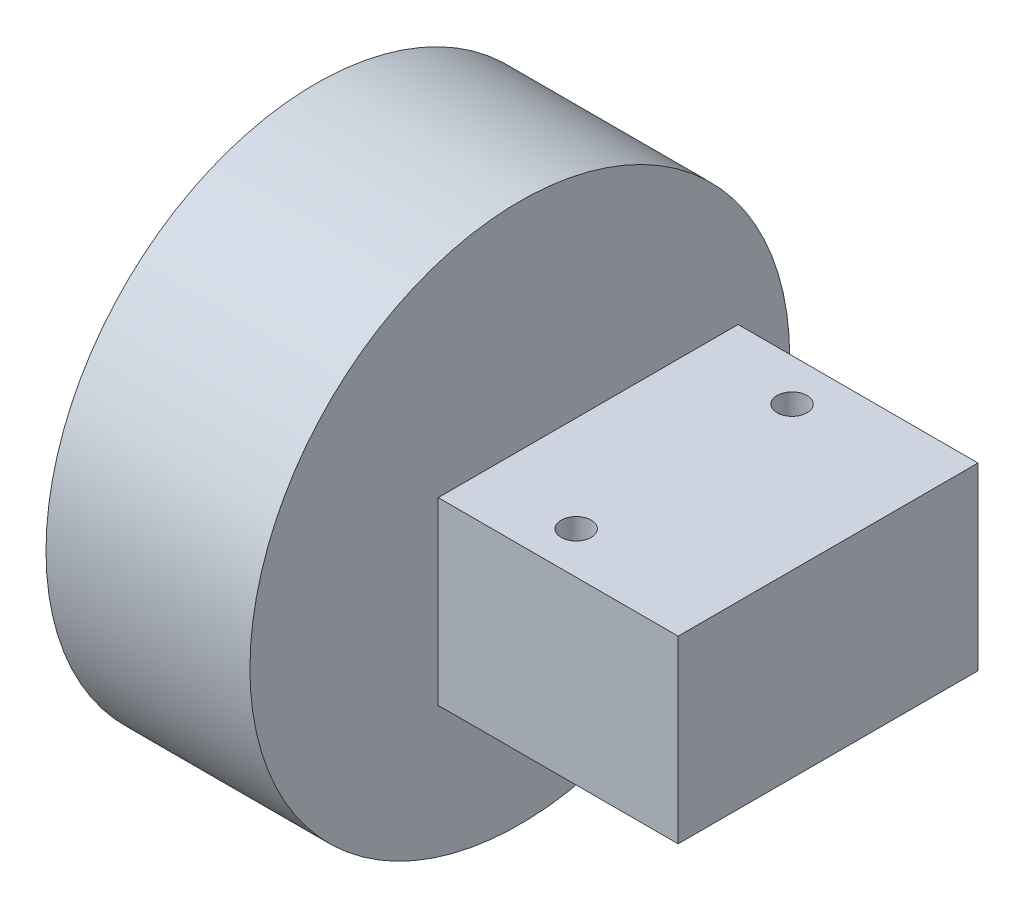
ISO-10303-21;
HEADER;
FILE_DESCRIPTION(('STEP AP214'),'2;1');
FILE_NAME('part.step','',(''),(''),'','','');
FILE_SCHEMA(('AUTOMOTIVE_DESIGN { 1 0 10303 214 1 1 1 1 }'));
ENDSEC;
DATA;
#1=APPLICATION_CONTEXT('core data for automotive mechanical design processes');
#2=APPLICATION_PROTOCOL_DEFINITION('international standard','automotive_design',2000,#1);
#3=PRODUCT_CONTEXT('',#1,'mechanical');
#4=PRODUCT('Part','Part','',(#3));
#5=PRODUCT_RELATED_PRODUCT_CATEGORY('part','',(#4));
#6=PRODUCT_DEFINITION_FORMATION('','',#4);
#7=PRODUCT_DEFINITION_CONTEXT('part definition',#1,'design');
#8=PRODUCT_DEFINITION('design','',#6,#7);
#9=PRODUCT_DEFINITION_SHAPE('','',#8);
#10=(LENGTH_UNIT() NAMED_UNIT(*) SI_UNIT(.MILLI.,.METRE.));
#11=(NAMED_UNIT(*) PLANE_ANGLE_UNIT() SI_UNIT($,.RADIAN.));
#12=(NAMED_UNIT(*) SI_UNIT($,.STERADIAN.) SOLID_ANGLE_UNIT());
#13=UNCERTAINTY_MEASURE_WITH_UNIT(LENGTH_MEASURE(1.E-05),#10,'distance_accuracy_value','');
#14=(GEOMETRIC_REPRESENTATION_CONTEXT(3) GLOBAL_UNCERTAINTY_ASSIGNED_CONTEXT((#13)) GLOBAL_UNIT_ASSIGNED_CONTEXT((#10,
#11,#12)) REPRESENTATION_CONTEXT('',''));
#15=CARTESIAN_POINT('',(0.,0.,0.));
#16=DIRECTION('',(0.,0.,1.));
#17=DIRECTION('',(1.,0.,0.));
#18=AXIS2_PLACEMENT_3D('',#15,#16,#17);
#19=CARTESIAN_POINT('',(-38.5,15.,-12.5));
#20=DIRECTION('',(-1.,0.,0.));
#21=DIRECTION('',(0.,0.,1.));
#22=AXIS2_PLACEMENT_3D('',#19,#20,#21);
#23=PLANE('',#22);
#24=DIRECTION('',(0.,0.,-1.));
#25=VECTOR('',#24,1.);
#26=CARTESIAN_POINT('',(-38.5,0.,-12.5));
#27=LINE('',#26,#25);
#28=CARTESIAN_POINT('',(-38.5,0.,12.5));
#29=VERTEX_POINT('',#28);
#30=CARTESIAN_POINT('',(-38.5,0.,-12.5));
#31=VERTEX_POINT('',#30);
#32=EDGE_CURVE('E102',#29,#31,#27,.T.);
#33=ORIENTED_EDGE('',*,*,#32,.T.);
#34=DIRECTION('',(0.,-1.,0.));
#35=VECTOR('',#34,1.);
#36=CARTESIAN_POINT('',(-38.5,15.,-12.5));
#37=LINE('',#36,#35);
#38=CARTESIAN_POINT('',(-38.5,15.,-12.5));
#39=VERTEX_POINT('',#38);
#40=EDGE_CURVE('E43',#39,#31,#37,.T.);
#41=ORIENTED_EDGE('',*,*,#40,.F.);
#42=DIRECTION('',(0.,0.,-1.));
#43=VECTOR('',#42,1.);
#44=CARTESIAN_POINT('',(-38.5,15.,-12.5));
#45=LINE('',#44,#43);
#46=CARTESIAN_POINT('',(-38.5,15.,12.5));
#47=VERTEX_POINT('',#46);
#48=EDGE_CURVE('E88',#47,#39,#45,.T.);
#49=ORIENTED_EDGE('',*,*,#48,.F.);
#50=DIRECTION('',(0.,-1.,0.));
#51=VECTOR('',#50,1.);
#52=CARTESIAN_POINT('',(-38.5,15.,12.5));
#53=LINE('',#52,#51);
#54=EDGE_CURVE('E98',#47,#29,#53,.T.);
#55=ORIENTED_EDGE('',*,*,#54,.T.);
#56=EDGE_LOOP('',(#33,#41,#49,#55));
#57=FACE_BOUND('',#56,.T.);
#58=ADVANCED_FACE('F34',(#57),#23,.F.);
#59=CARTESIAN_POINT('',(-58.5,15.,-12.5));
#60=DIRECTION('',(0.,0.,1.));
#61=DIRECTION('',(1.,0.,0.));
#62=AXIS2_PLACEMENT_3D('',#59,#60,#61);
#63=PLANE('',#62);
#64=DIRECTION('',(-1.,0.,0.));
#65=VECTOR('',#64,1.);
#66=CARTESIAN_POINT('',(-58.5,0.,-12.5));
#67=LINE('',#66,#65);
#68=CARTESIAN_POINT('',(-58.5,0.,-12.5));
#69=VERTEX_POINT('',#68);
#70=EDGE_CURVE('E93',#31,#69,#67,.T.);
#71=ORIENTED_EDGE('',*,*,#70,.T.);
#72=DIRECTION('',(0.,-1.,0.));
#73=VECTOR('',#72,1.);
#74=CARTESIAN_POINT('',(-58.5,15.,-12.5));
#75=LINE('',#74,#73);
#76=CARTESIAN_POINT('',(-58.5,15.,-12.5));
#77=VERTEX_POINT('',#76);
#78=EDGE_CURVE('E91',#77,#69,#75,.T.);
#79=ORIENTED_EDGE('',*,*,#78,.F.);
#80=DIRECTION('',(-1.,0.,0.));
#81=VECTOR('',#80,1.);
#82=CARTESIAN_POINT('',(-58.5,15.,-12.5));
#83=LINE('',#82,#81);
#84=EDGE_CURVE('E83',#39,#77,#83,.T.);
#85=ORIENTED_EDGE('',*,*,#84,.F.);
#86=ORIENTED_EDGE('',*,*,#40,.T.);
#87=EDGE_LOOP('',(#71,#79,#85,#86));
#88=FACE_BOUND('',#87,.T.);
#89=ADVANCED_FACE('F92',(#88),#63,.F.);
#90=CARTESIAN_POINT('',(-58.5,15.,-12.5));
#91=DIRECTION('',(1.,0.,0.));
#92=DIRECTION('',(0.,0.,-1.));
#93=AXIS2_PLACEMENT_3D('',#90,#91,#92);
#94=PLANE('',#93);
#95=CARTESIAN_POINT('',(-58.5,4.8,0.));
#96=DIRECTION('',(1.,0.,0.));
#97=DIRECTION('',(0.,0.,-1.));
#98=AXIS2_PLACEMENT_3D('',#95,#96,#97);
#99=CIRCLE('',#98,1.);
#100=CARTESIAN_POINT('',(-58.5,4.8,-1.00000000000001));
#101=VERTEX_POINT('',#100);
#102=EDGE_CURVE('E11',#101,#101,#99,.F.);
#103=ORIENTED_EDGE('',*,*,#102,.F.);
#104=EDGE_LOOP('',(#103));
#105=FACE_BOUND('',#104,.T.);
#106=DIRECTION('',(0.,0.,1.));
#107=VECTOR('',#106,1.);
#108=CARTESIAN_POINT('',(-58.5,0.,-12.5));
#109=LINE('',#108,#107);
#110=CARTESIAN_POINT('',(-58.5,0.,12.5));
#111=VERTEX_POINT('',#110);
#112=EDGE_CURVE('E69',#69,#111,#109,.T.);
#113=ORIENTED_EDGE('',*,*,#112,.T.);
#114=DIRECTION('',(0.,-1.,0.));
#115=VECTOR('',#114,1.);
#116=CARTESIAN_POINT('',(-58.5,15.,12.5));
#117=LINE('',#116,#115);
#118=CARTESIAN_POINT('',(-58.5,15.,12.5));
#119=VERTEX_POINT('',#118);
#120=EDGE_CURVE('E94',#119,#111,#117,.T.);
#121=ORIENTED_EDGE('',*,*,#120,.F.);
#122=DIRECTION('',(0.,0.,1.));
#123=VECTOR('',#122,1.);
#124=CARTESIAN_POINT('',(-58.5,15.,-12.5));
#125=LINE('',#124,#123);
#126=EDGE_CURVE('E86',#77,#119,#125,.T.);
#127=ORIENTED_EDGE('',*,*,#126,.F.);
#128=ORIENTED_EDGE('',*,*,#78,.T.);
#129=EDGE_LOOP('',(#113,#121,#127,#128));
#130=FACE_BOUND('',#129,.T.);
#131=ADVANCED_FACE('F96',(#105,#130),#94,.F.);
#132=CARTESIAN_POINT('',(-58.5,15.,12.5));
#133=DIRECTION('',(0.,0.,-1.));
#134=DIRECTION('',(-1.,0.,0.));
#135=AXIS2_PLACEMENT_3D('',#132,#133,#134);
#136=PLANE('',#135);
#137=DIRECTION('',(1.,0.,0.));
#138=VECTOR('',#137,1.);
#139=CARTESIAN_POINT('',(-58.5,0.,12.5));
#140=LINE('',#139,#138);
#141=EDGE_CURVE('E75',#111,#29,#140,.T.);
#142=ORIENTED_EDGE('',*,*,#141,.T.);
#143=ORIENTED_EDGE('',*,*,#54,.F.);
#144=DIRECTION('',(1.,0.,0.));
#145=VECTOR('',#144,1.);
#146=CARTESIAN_POINT('',(-58.5,15.,12.5));
#147=LINE('',#146,#145);
#148=EDGE_CURVE('E52',#119,#47,#147,.T.);
#149=ORIENTED_EDGE('',*,*,#148,.F.);
#150=ORIENTED_EDGE('',*,*,#120,.T.);
#151=EDGE_LOOP('',(#142,#143,#149,#150));
#152=FACE_BOUND('',#151,.T.);
#153=ADVANCED_FACE('F146',(#152),#136,.F.);
#154=CARTESIAN_POINT('',(0.,15.,0.));
#155=DIRECTION('',(0.,1.,0.));
#156=DIRECTION('',(0.,0.,1.));
#157=AXIS2_PLACEMENT_3D('',#154,#155,#156);
#158=PLANE('',#157);
#159=CARTESIAN_POINT('',(-50.5,15.,-9.00000000000001));
#160=DIRECTION('',(0.,1.,0.));
#161=DIRECTION('',(0.,0.,1.));
#162=AXIS2_PLACEMENT_3D('',#159,#160,#161);
#163=CIRCLE('',#162,1.25);
#164=CARTESIAN_POINT('',(-50.5,15.,-7.75000000000001));
#165=VERTEX_POINT('',#164);
#166=EDGE_CURVE('E113',#165,#165,#163,.T.);
#167=ORIENTED_EDGE('',*,*,#166,.F.);
#168=EDGE_LOOP('',(#167));
#169=FACE_BOUND('',#168,.T.);
#170=CARTESIAN_POINT('',(-50.5,15.,8.99999999999999));
#171=DIRECTION('',(0.,1.,0.));
#172=DIRECTION('',(0.,0.,1.));
#173=AXIS2_PLACEMENT_3D('',#170,#171,#172);
#174=CIRCLE('',#173,1.25);
#175=CARTESIAN_POINT('',(-50.5,15.,10.25));
#176=VERTEX_POINT('',#175);
#177=EDGE_CURVE('E119',#176,#176,#174,.T.);
#178=ORIENTED_EDGE('',*,*,#177,.F.);
#179=EDGE_LOOP('',(#178));
#180=FACE_BOUND('',#179,.T.);
#181=ORIENTED_EDGE('',*,*,#48,.T.);
#182=ORIENTED_EDGE('',*,*,#84,.T.);
#183=ORIENTED_EDGE('',*,*,#126,.T.);
#184=ORIENTED_EDGE('',*,*,#148,.T.);
#185=EDGE_LOOP('',(#181,#182,#183,#184));
#186=FACE_BOUND('',#185,.T.);
#187=ADVANCED_FACE('F84',(#169,#180,#186),#158,.T.);
#188=CARTESIAN_POINT('',(0.,0.,0.));
#189=DIRECTION('',(0.,1.,0.));
#190=DIRECTION('',(0.,0.,1.));
#191=AXIS2_PLACEMENT_3D('',#188,#189,#190);
#192=PLANE('',#191);
#193=CARTESIAN_POINT('',(-50.5,0.,-9.00000000000001));
#194=DIRECTION('',(0.,1.,0.));
#195=DIRECTION('',(0.,0.,1.));
#196=AXIS2_PLACEMENT_3D('',#193,#194,#195);
#197=CIRCLE('',#196,1.25);
#198=CARTESIAN_POINT('',(-50.5,0.,-7.75000000000001));
#199=VERTEX_POINT('',#198);
#200=EDGE_CURVE('E37',#199,#199,#197,.T.);
#201=ORIENTED_EDGE('',*,*,#200,.T.);
#202=EDGE_LOOP('',(#201));
#203=FACE_BOUND('',#202,.T.);
#204=CARTESIAN_POINT('',(-50.5,0.,8.99999999999999));
#205=DIRECTION('',(0.,1.,0.));
#206=DIRECTION('',(0.,0.,1.));
#207=AXIS2_PLACEMENT_3D('',#204,#205,#206);
#208=CIRCLE('',#207,1.25);
#209=CARTESIAN_POINT('',(-50.5,0.,10.25));
#210=VERTEX_POINT('',#209);
#211=EDGE_CURVE('E111',#210,#210,#208,.T.);
#212=ORIENTED_EDGE('',*,*,#211,.T.);
#213=EDGE_LOOP('',(#212));
#214=FACE_BOUND('',#213,.T.);
#215=ORIENTED_EDGE('',*,*,#32,.F.);
#216=ORIENTED_EDGE('',*,*,#141,.F.);
#217=ORIENTED_EDGE('',*,*,#112,.F.);
#218=ORIENTED_EDGE('',*,*,#70,.F.);
#219=EDGE_LOOP('',(#215,#216,#217,#218));
#220=FACE_BOUND('',#219,.T.);
#221=ADVANCED_FACE('F141',(#203,#214,#220),#192,.F.);
#222=CARTESIAN_POINT('',(-64.2,4.8,0.));
#223=DIRECTION('',(1.,0.,0.));
#224=DIRECTION('',(0.,0.,-1.));
#225=AXIS2_PLACEMENT_3D('',#222,#223,#224);
#226=CYLINDRICAL_SURFACE('',#225,1.);
#227=CARTESIAN_POINT('',(-64.2,4.8,0.));
#228=DIRECTION('',(-1.,0.,0.));
#229=DIRECTION('',(0.,0.,1.));
#230=AXIS2_PLACEMENT_3D('',#227,#228,#229);
#231=CIRCLE('',#230,1.);
#232=CARTESIAN_POINT('',(-64.2,4.8,0.999999999999986));
#233=VERTEX_POINT('',#232);
#234=EDGE_CURVE('E105',#233,#233,#231,.T.);
#235=ORIENTED_EDGE('',*,*,#234,.F.);
#236=EDGE_LOOP('',(#235));
#237=FACE_BOUND('',#236,.T.);
#238=ORIENTED_EDGE('',*,*,#102,.T.);
#239=EDGE_LOOP('',(#238));
#240=FACE_BOUND('',#239,.T.);
#241=ADVANCED_FACE('F137',(#237,#240),#226,.T.);
#242=CARTESIAN_POINT('',(-81.2,4.8,0.));
#243=DIRECTION('',(1.,0.,0.));
#244=DIRECTION('',(0.,0.,-1.));
#245=AXIS2_PLACEMENT_3D('',#242,#243,#244);
#246=CYLINDRICAL_SURFACE('',#245,22.5);
#247=CARTESIAN_POINT('',(-81.2,4.8,0.));
#248=DIRECTION('',(-1.,0.,0.));
#249=DIRECTION('',(0.,0.,1.));
#250=AXIS2_PLACEMENT_3D('',#247,#248,#249);
#251=CIRCLE('',#250,22.5);
#252=CARTESIAN_POINT('',(-81.2,4.8,22.5));
#253=VERTEX_POINT('',#252);
#254=EDGE_CURVE('E126',#253,#253,#251,.T.);
#255=ORIENTED_EDGE('',*,*,#254,.F.);
#256=EDGE_LOOP('',(#255));
#257=FACE_BOUND('',#256,.T.);
#258=CARTESIAN_POINT('',(-64.2,4.8,0.));
#259=DIRECTION('',(-1.,0.,0.));
#260=DIRECTION('',(0.,0.,1.));
#261=AXIS2_PLACEMENT_3D('',#258,#259,#260);
#262=CIRCLE('',#261,22.5);
#263=CARTESIAN_POINT('',(-64.2,4.8,22.5));
#264=VERTEX_POINT('',#263);
#265=EDGE_CURVE('E117',#264,#264,#262,.T.);
#266=ORIENTED_EDGE('',*,*,#265,.T.);
#267=EDGE_LOOP('',(#266));
#268=FACE_BOUND('',#267,.T.);
#269=ADVANCED_FACE('F140',(#257,#268),#246,.T.);
#270=CARTESIAN_POINT('',(-81.2,4.8,0.));
#271=DIRECTION('',(-1.,0.,0.));
#272=DIRECTION('',(0.,0.,1.));
#273=AXIS2_PLACEMENT_3D('',#270,#271,#272);
#274=PLANE('',#273);
#275=ORIENTED_EDGE('',*,*,#254,.T.);
#276=EDGE_LOOP('',(#275));
#277=FACE_BOUND('',#276,.T.);
#278=ADVANCED_FACE('F173',(#277),#274,.T.);
#279=CARTESIAN_POINT('',(-64.2,4.8,0.));
#280=DIRECTION('',(-1.,0.,0.));
#281=DIRECTION('',(0.,0.,1.));
#282=AXIS2_PLACEMENT_3D('',#279,#280,#281);
#283=PLANE('',#282);
#284=ORIENTED_EDGE('',*,*,#234,.T.);
#285=EDGE_LOOP('',(#284));
#286=FACE_BOUND('',#285,.T.);
#287=ORIENTED_EDGE('',*,*,#265,.F.);
#288=EDGE_LOOP('',(#287));
#289=FACE_BOUND('',#288,.T.);
#290=ADVANCED_FACE('F134',(#286,#289),#283,.F.);
#291=CARTESIAN_POINT('',(-50.5,-17.7,8.99999999999999));
#292=DIRECTION('',(0.,1.,0.));
#293=DIRECTION('',(0.,0.,1.));
#294=AXIS2_PLACEMENT_3D('',#291,#292,#293);
#295=CYLINDRICAL_SURFACE('',#294,1.25);
#296=ORIENTED_EDGE('',*,*,#177,.T.);
#297=EDGE_LOOP('',(#296));
#298=FACE_BOUND('',#297,.T.);
#299=ORIENTED_EDGE('',*,*,#211,.F.);
#300=EDGE_LOOP('',(#299));
#301=FACE_BOUND('',#300,.T.);
#302=ADVANCED_FACE('F177',(#298,#301),#295,.F.);
#303=CARTESIAN_POINT('',(-50.5,-17.7,-9.00000000000001));
#304=DIRECTION('',(0.,1.,0.));
#305=DIRECTION('',(0.,0.,1.));
#306=AXIS2_PLACEMENT_3D('',#303,#304,#305);
#307=CYLINDRICAL_SURFACE('',#306,1.25);
#308=ORIENTED_EDGE('',*,*,#166,.T.);
#309=EDGE_LOOP('',(#308));
#310=FACE_BOUND('',#309,.T.);
#311=ORIENTED_EDGE('',*,*,#200,.F.);
#312=EDGE_LOOP('',(#311));
#313=FACE_BOUND('',#312,.T.);
#314=ADVANCED_FACE('F183',(#310,#313),#307,.F.);
#315=CLOSED_SHELL('',(#58,#89,#131,#153,#187,#221,#241,#269,#278,#290,#302,#314));
#316=MANIFOLD_SOLID_BREP('B2',#315);
#317=ADVANCED_BREP_SHAPE_REPRESENTATION('',(#18,#316),#14);
#318=SHAPE_DEFINITION_REPRESENTATION(#9,#317);
ENDSEC;
END-ISO-10303-21;
